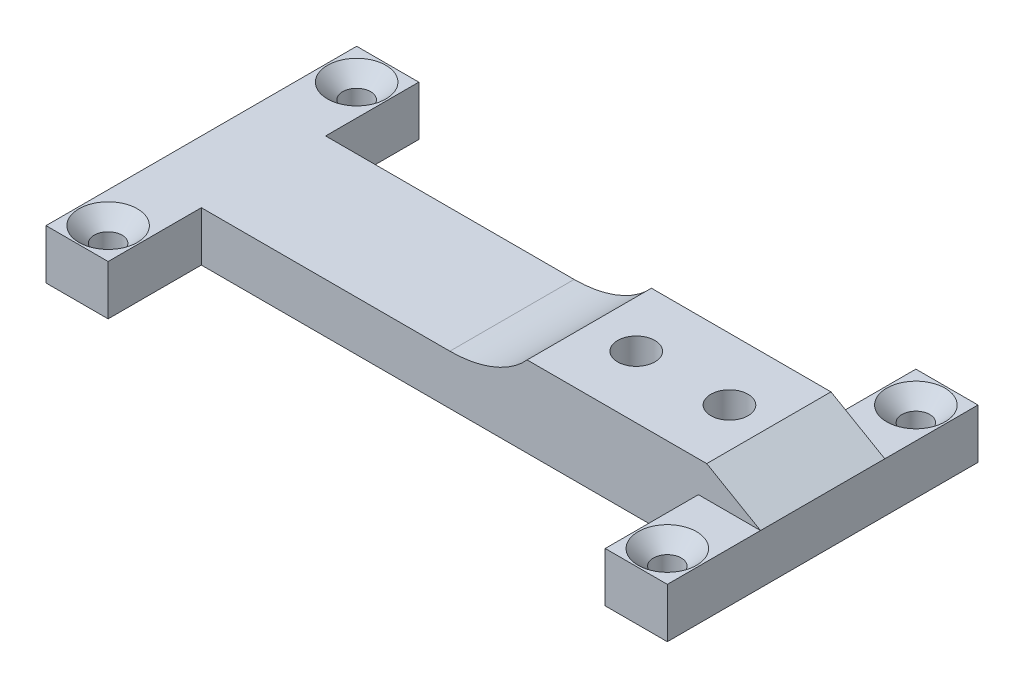
ISO-10303-21;
HEADER;
FILE_DESCRIPTION(('STEP AP214'),'2;1');
FILE_NAME('part.step','',(''),(''),'','','');
FILE_SCHEMA(('AUTOMOTIVE_DESIGN { 1 0 10303 214 1 1 1 1 }'));
ENDSEC;
DATA;
#1=APPLICATION_CONTEXT('core data for automotive mechanical design processes');
#2=APPLICATION_PROTOCOL_DEFINITION('international standard','automotive_design',2000,#1);
#3=PRODUCT_CONTEXT('',#1,'mechanical');
#4=PRODUCT('Part','Part','',(#3));
#5=PRODUCT_RELATED_PRODUCT_CATEGORY('part','',(#4));
#6=PRODUCT_DEFINITION_FORMATION('','',#4);
#7=PRODUCT_DEFINITION_CONTEXT('part definition',#1,'design');
#8=PRODUCT_DEFINITION('design','',#6,#7);
#9=PRODUCT_DEFINITION_SHAPE('','',#8);
#10=(LENGTH_UNIT() NAMED_UNIT(*) SI_UNIT(.MILLI.,.METRE.));
#11=(NAMED_UNIT(*) PLANE_ANGLE_UNIT() SI_UNIT($,.RADIAN.));
#12=(NAMED_UNIT(*) SI_UNIT($,.STERADIAN.) SOLID_ANGLE_UNIT());
#13=UNCERTAINTY_MEASURE_WITH_UNIT(LENGTH_MEASURE(1.E-05),#10,'distance_accuracy_value','');
#14=(GEOMETRIC_REPRESENTATION_CONTEXT(3) GLOBAL_UNCERTAINTY_ASSIGNED_CONTEXT((#13)) GLOBAL_UNIT_ASSIGNED_CONTEXT((#10,
#11,#12)) REPRESENTATION_CONTEXT('',''));
#15=CARTESIAN_POINT('',(0.,0.,0.));
#16=DIRECTION('',(0.,0.,1.));
#17=DIRECTION('',(1.,0.,0.));
#18=AXIS2_PLACEMENT_3D('',#15,#16,#17);
#19=CARTESIAN_POINT('',(0.,0.,0.));
#20=DIRECTION('',(0.,0.,1.));
#21=DIRECTION('',(1.,0.,0.));
#22=AXIS2_PLACEMENT_3D('',#19,#20,#21);
#23=PLANE('',#22);
#24=DIRECTION('',(-1.,0.,0.));
#25=VECTOR('',#24,1.);
#26=CARTESIAN_POINT('',(50.,-11.35,0.));
#27=LINE('',#26,#25);
#28=CARTESIAN_POINT('',(50.,-11.35,0.));
#29=VERTEX_POINT('',#28);
#30=CARTESIAN_POINT('',(40.,-11.35,0.));
#31=VERTEX_POINT('',#30);
#32=EDGE_CURVE('E64',#29,#31,#27,.T.);
#33=ORIENTED_EDGE('',*,*,#32,.T.);
#34=DIRECTION('',(0.,-1.,0.));
#35=VECTOR('',#34,1.);
#36=CARTESIAN_POINT('',(40.,-11.35,0.));
#37=LINE('',#36,#35);
#38=CARTESIAN_POINT('',(40.,-19.35,0.));
#39=VERTEX_POINT('',#38);
#40=EDGE_CURVE('E68',#31,#39,#37,.T.);
#41=ORIENTED_EDGE('',*,*,#40,.T.);
#42=DIRECTION('',(-1.,0.,0.));
#43=VECTOR('',#42,1.);
#44=CARTESIAN_POINT('',(0.,-19.35,0.));
#45=LINE('',#44,#43);
#46=CARTESIAN_POINT('',(-40.,-19.35,0.));
#47=VERTEX_POINT('',#46);
#48=EDGE_CURVE('E365',#39,#47,#45,.T.);
#49=ORIENTED_EDGE('',*,*,#48,.T.);
#50=DIRECTION('',(0.,-1.,0.));
#51=VECTOR('',#50,1.);
#52=CARTESIAN_POINT('',(-40.,-11.35,0.));
#53=LINE('',#52,#51);
#54=CARTESIAN_POINT('',(-40.,-11.35,0.));
#55=VERTEX_POINT('',#54);
#56=EDGE_CURVE('E217',#55,#47,#53,.T.);
#57=ORIENTED_EDGE('',*,*,#56,.F.);
#58=DIRECTION('',(-1.,0.,0.));
#59=VECTOR('',#58,1.);
#60=CARTESIAN_POINT('',(0.,-11.35,0.));
#61=LINE('',#60,#59);
#62=CARTESIAN_POINT('',(0.,-11.35,0.));
#63=VERTEX_POINT('',#62);
#64=EDGE_CURVE('E373',#63,#55,#61,.T.);
#65=ORIENTED_EDGE('',*,*,#64,.F.);
#66=CARTESIAN_POINT('',(0.,0.,0.));
#67=DIRECTION('',(0.,0.,1.));
#68=DIRECTION('',(-1.,0.,0.));
#69=AXIS2_PLACEMENT_3D('',#66,#67,#68);
#70=ELLIPSE('',#69,15.,11.35);
#71=CARTESIAN_POINT('',(12.4327451908988,-6.35,0.));
#72=VERTEX_POINT('',#71);
#73=EDGE_CURVE('E615',#63,#72,#70,.T.);
#74=ORIENTED_EDGE('',*,*,#73,.T.);
#75=DIRECTION('',(1.,0.,0.));
#76=VECTOR('',#75,1.);
#77=CARTESIAN_POINT('',(0.,-6.35,0.));
#78=LINE('',#77,#76);
#79=CARTESIAN_POINT('',(41.3397459621555,-6.35,0.));
#80=VERTEX_POINT('',#79);
#81=EDGE_CURVE('E609',#72,#80,#78,.T.);
#82=ORIENTED_EDGE('',*,*,#81,.T.);
#83=DIRECTION('',(-0.866025403784442,0.499999999999995,0.));
#84=VECTOR('',#83,1.);
#85=CARTESIAN_POINT('',(7.58530583352309,13.1381350946108,0.));
#86=LINE('',#85,#84);
#87=EDGE_CURVE('E607',#29,#80,#86,.T.);
#88=ORIENTED_EDGE('',*,*,#87,.F.);
#89=EDGE_LOOP('',(#33,#41,#49,#57,#65,#74,#82,#88));
#90=FACE_BOUND('',#89,.T.);
#91=ADVANCED_FACE('F47',(#90),#23,.F.);
#92=CARTESIAN_POINT('',(0.,0.,20.));
#93=DIRECTION('',(0.,0.,1.));
#94=DIRECTION('',(1.,0.,0.));
#95=AXIS2_PLACEMENT_3D('',#92,#93,#94);
#96=PLANE('',#95);
#97=DIRECTION('',(0.,-1.,0.));
#98=VECTOR('',#97,1.);
#99=CARTESIAN_POINT('',(40.,-11.35,20.));
#100=LINE('',#99,#98);
#101=CARTESIAN_POINT('',(40.,-11.35,20.));
#102=VERTEX_POINT('',#101);
#103=CARTESIAN_POINT('',(40.,-19.35,20.));
#104=VERTEX_POINT('',#103);
#105=EDGE_CURVE('E250',#102,#104,#100,.T.);
#106=ORIENTED_EDGE('',*,*,#105,.F.);
#107=DIRECTION('',(1.,0.,0.));
#108=VECTOR('',#107,1.);
#109=CARTESIAN_POINT('',(50.,-11.35,20.));
#110=LINE('',#109,#108);
#111=CARTESIAN_POINT('',(50.,-11.35,20.));
#112=VERTEX_POINT('',#111);
#113=EDGE_CURVE('E259',#102,#112,#110,.T.);
#114=ORIENTED_EDGE('',*,*,#113,.T.);
#115=DIRECTION('',(-0.866025403784442,0.499999999999995,0.));
#116=VECTOR('',#115,1.);
#117=CARTESIAN_POINT('',(7.58530583352309,13.1381350946108,20.));
#118=LINE('',#117,#116);
#119=CARTESIAN_POINT('',(41.3397459621555,-6.35,20.));
#120=VERTEX_POINT('',#119);
#121=EDGE_CURVE('E372',#112,#120,#118,.T.);
#122=ORIENTED_EDGE('',*,*,#121,.T.);
#123=DIRECTION('',(1.,0.,0.));
#124=VECTOR('',#123,1.);
#125=CARTESIAN_POINT('',(0.,-6.35,20.));
#126=LINE('',#125,#124);
#127=CARTESIAN_POINT('',(12.4327451908988,-6.35,20.));
#128=VERTEX_POINT('',#127);
#129=EDGE_CURVE('E376',#128,#120,#126,.T.);
#130=ORIENTED_EDGE('',*,*,#129,.F.);
#131=CARTESIAN_POINT('',(0.,0.,20.));
#132=DIRECTION('',(0.,0.,1.));
#133=DIRECTION('',(-1.,0.,0.));
#134=AXIS2_PLACEMENT_3D('',#131,#132,#133);
#135=ELLIPSE('',#134,15.,11.35);
#136=CARTESIAN_POINT('',(0.,-11.35,20.));
#137=VERTEX_POINT('',#136);
#138=EDGE_CURVE('E380',#137,#128,#135,.T.);
#139=ORIENTED_EDGE('',*,*,#138,.F.);
#140=DIRECTION('',(-1.,0.,0.));
#141=VECTOR('',#140,1.);
#142=CARTESIAN_POINT('',(0.,-11.35,20.));
#143=LINE('',#142,#141);
#144=CARTESIAN_POINT('',(-40.,-11.35,20.));
#145=VERTEX_POINT('',#144);
#146=EDGE_CURVE('E385',#137,#145,#143,.T.);
#147=ORIENTED_EDGE('',*,*,#146,.T.);
#148=DIRECTION('',(0.,-1.,0.));
#149=VECTOR('',#148,1.);
#150=CARTESIAN_POINT('',(-40.,-11.35,20.));
#151=LINE('',#150,#149);
#152=CARTESIAN_POINT('',(-40.,-19.35,20.));
#153=VERTEX_POINT('',#152);
#154=EDGE_CURVE('E295',#145,#153,#151,.T.);
#155=ORIENTED_EDGE('',*,*,#154,.T.);
#156=DIRECTION('',(-1.,0.,0.));
#157=VECTOR('',#156,1.);
#158=CARTESIAN_POINT('',(0.,-19.35,20.));
#159=LINE('',#158,#157);
#160=EDGE_CURVE('E369',#104,#153,#159,.T.);
#161=ORIENTED_EDGE('',*,*,#160,.F.);
#162=EDGE_LOOP('',(#106,#114,#122,#130,#139,#147,#155,#161));
#163=FACE_BOUND('',#162,.T.);
#164=ADVANCED_FACE('F416',(#163),#96,.T.);
#165=CARTESIAN_POINT('',(35.,-23.35,10.));
#166=DIRECTION('',(0.,1.,0.));
#167=DIRECTION('',(0.,0.,1.));
#168=AXIS2_PLACEMENT_3D('',#165,#166,#167);
#169=CYLINDRICAL_SURFACE('',#168,3.);
#170=CARTESIAN_POINT('',(35.,-6.35,10.));
#171=DIRECTION('',(0.,1.,0.));
#172=DIRECTION('',(0.,0.,1.));
#173=AXIS2_PLACEMENT_3D('',#170,#171,#172);
#174=CIRCLE('',#173,3.);
#175=CARTESIAN_POINT('',(35.,-6.35,13.));
#176=VERTEX_POINT('',#175);
#177=EDGE_CURVE('E360',#176,#176,#174,.T.);
#178=ORIENTED_EDGE('',*,*,#177,.T.);
#179=EDGE_LOOP('',(#178));
#180=FACE_BOUND('',#179,.T.);
#181=CARTESIAN_POINT('',(35.,-15.35,10.));
#182=DIRECTION('',(0.,-1.,0.));
#183=DIRECTION('',(1.,0.,0.));
#184=AXIS2_PLACEMENT_3D('',#181,#182,#183);
#185=CIRCLE('',#184,3.);
#186=CARTESIAN_POINT('',(38.,-15.35,10.));
#187=VERTEX_POINT('',#186);
#188=EDGE_CURVE('E356',#187,#187,#185,.F.);
#189=ORIENTED_EDGE('',*,*,#188,.F.);
#190=EDGE_LOOP('',(#189));
#191=FACE_BOUND('',#190,.T.);
#192=ADVANCED_FACE('F421',(#180,#191),#169,.F.);
#193=CARTESIAN_POINT('',(20.,-23.35,10.));
#194=DIRECTION('',(0.,1.,0.));
#195=DIRECTION('',(0.,0.,1.));
#196=AXIS2_PLACEMENT_3D('',#193,#194,#195);
#197=CYLINDRICAL_SURFACE('',#196,3.);
#198=CARTESIAN_POINT('',(20.,-6.35,10.));
#199=DIRECTION('',(0.,1.,0.));
#200=DIRECTION('',(0.,0.,1.));
#201=AXIS2_PLACEMENT_3D('',#198,#199,#200);
#202=CIRCLE('',#201,3.);
#203=CARTESIAN_POINT('',(20.,-6.35,13.));
#204=VERTEX_POINT('',#203);
#205=EDGE_CURVE('E361',#204,#204,#202,.T.);
#206=ORIENTED_EDGE('',*,*,#205,.T.);
#207=EDGE_LOOP('',(#206));
#208=FACE_BOUND('',#207,.T.);
#209=CARTESIAN_POINT('',(20.,-15.35,10.));
#210=DIRECTION('',(0.,-1.,0.));
#211=DIRECTION('',(1.,0.,0.));
#212=AXIS2_PLACEMENT_3D('',#209,#210,#211);
#213=CIRCLE('',#212,3.);
#214=CARTESIAN_POINT('',(23.,-15.35,10.));
#215=VERTEX_POINT('',#214);
#216=EDGE_CURVE('E51',#215,#215,#213,.F.);
#217=ORIENTED_EDGE('',*,*,#216,.F.);
#218=EDGE_LOOP('',(#217));
#219=FACE_BOUND('',#218,.T.);
#220=ADVANCED_FACE('F411',(#208,#219),#197,.F.);
#221=CARTESIAN_POINT('',(-50.,0.,20.));
#222=DIRECTION('',(-1.,0.,0.));
#223=DIRECTION('',(0.,0.,1.));
#224=AXIS2_PLACEMENT_3D('',#221,#222,#223);
#225=PLANE('',#224);
#226=DIRECTION('',(0.,0.,-1.));
#227=VECTOR('',#226,1.);
#228=CARTESIAN_POINT('',(-50.,-11.35,20.));
#229=LINE('',#228,#227);
#230=CARTESIAN_POINT('',(-50.,-11.35,35.));
#231=VERTEX_POINT('',#230);
#232=CARTESIAN_POINT('',(-50.,-11.35,-15.));
#233=VERTEX_POINT('',#232);
#234=EDGE_CURVE('E599',#231,#233,#229,.T.);
#235=ORIENTED_EDGE('',*,*,#234,.T.);
#236=DIRECTION('',(0.,-1.,0.));
#237=VECTOR('',#236,1.);
#238=CARTESIAN_POINT('',(-50.,-11.35,-15.));
#239=LINE('',#238,#237);
#240=CARTESIAN_POINT('',(-50.,-19.35,-15.));
#241=VERTEX_POINT('',#240);
#242=EDGE_CURVE('E230',#233,#241,#239,.T.);
#243=ORIENTED_EDGE('',*,*,#242,.T.);
#244=DIRECTION('',(0.,0.,-1.));
#245=VECTOR('',#244,1.);
#246=CARTESIAN_POINT('',(-50.,-19.35,20.));
#247=LINE('',#246,#245);
#248=CARTESIAN_POINT('',(-50.,-19.35,35.));
#249=VERTEX_POINT('',#248);
#250=EDGE_CURVE('E11',#249,#241,#247,.T.);
#251=ORIENTED_EDGE('',*,*,#250,.F.);
#252=DIRECTION('',(0.,-1.,0.));
#253=VECTOR('',#252,1.);
#254=CARTESIAN_POINT('',(-50.,-11.35,35.));
#255=LINE('',#254,#253);
#256=EDGE_CURVE('E302',#231,#249,#255,.T.);
#257=ORIENTED_EDGE('',*,*,#256,.F.);
#258=EDGE_LOOP('',(#235,#243,#251,#257));
#259=FACE_BOUND('',#258,.T.);
#260=ADVANCED_FACE('F49',(#259),#225,.T.);
#261=CARTESIAN_POINT('',(0.,-19.35,20.));
#262=DIRECTION('',(0.,-1.,0.));
#263=DIRECTION('',(1.,0.,0.));
#264=AXIS2_PLACEMENT_3D('',#261,#262,#263);
#265=PLANE('',#264);
#266=CARTESIAN_POINT('',(-45.,-19.35,-10.0000000000001));
#267=DIRECTION('',(0.,1.,0.));
#268=DIRECTION('',(0.,0.,1.));
#269=AXIS2_PLACEMENT_3D('',#266,#267,#268);
#270=CIRCLE('',#269,2.25);
#271=CARTESIAN_POINT('',(-45.,-19.35,-7.75000000000013));
#272=VERTEX_POINT('',#271);
#273=EDGE_CURVE('E531',#272,#272,#270,.T.);
#274=ORIENTED_EDGE('',*,*,#273,.T.);
#275=EDGE_LOOP('',(#274));
#276=FACE_BOUND('',#275,.T.);
#277=CARTESIAN_POINT('',(-45.,-19.35,30.));
#278=DIRECTION('',(0.,1.,0.));
#279=DIRECTION('',(0.,0.,1.));
#280=AXIS2_PLACEMENT_3D('',#277,#278,#279);
#281=CIRCLE('',#280,2.25);
#282=CARTESIAN_POINT('',(-45.,-19.35,32.25));
#283=VERTEX_POINT('',#282);
#284=EDGE_CURVE('E544',#283,#283,#281,.T.);
#285=ORIENTED_EDGE('',*,*,#284,.T.);
#286=EDGE_LOOP('',(#285));
#287=FACE_BOUND('',#286,.T.);
#288=CARTESIAN_POINT('',(45.,-19.35,30.));
#289=DIRECTION('',(0.,1.,0.));
#290=DIRECTION('',(0.,0.,1.));
#291=AXIS2_PLACEMENT_3D('',#288,#289,#290);
#292=CIRCLE('',#291,2.25);
#293=CARTESIAN_POINT('',(45.,-19.35,32.25));
#294=VERTEX_POINT('',#293);
#295=EDGE_CURVE('E556',#294,#294,#292,.T.);
#296=ORIENTED_EDGE('',*,*,#295,.T.);
#297=EDGE_LOOP('',(#296));
#298=FACE_BOUND('',#297,.T.);
#299=CARTESIAN_POINT('',(45.,-19.35,-9.99999999999991));
#300=DIRECTION('',(0.,1.,0.));
#301=DIRECTION('',(0.,0.,1.));
#302=AXIS2_PLACEMENT_3D('',#299,#300,#301);
#303=CIRCLE('',#302,2.25);
#304=CARTESIAN_POINT('',(45.,-19.35,-7.74999999999991));
#305=VERTEX_POINT('',#304);
#306=EDGE_CURVE('E206',#305,#305,#303,.T.);
#307=ORIENTED_EDGE('',*,*,#306,.T.);
#308=EDGE_LOOP('',(#307));
#309=FACE_BOUND('',#308,.T.);
#310=CARTESIAN_POINT('',(20.,-19.35,10.));
#311=DIRECTION('',(0.,-1.,0.));
#312=DIRECTION('',(1.,0.,0.));
#313=AXIS2_PLACEMENT_3D('',#310,#311,#312);
#314=CIRCLE('',#313,5.5);
#315=CARTESIAN_POINT('',(20.,-19.35,15.5));
#316=VERTEX_POINT('',#315);
#317=CARTESIAN_POINT('',(20.,-19.35,4.5));
#318=VERTEX_POINT('',#317);
#319=EDGE_CURVE('E306',#316,#318,#314,.T.);
#320=ORIENTED_EDGE('',*,*,#319,.F.);
#321=DIRECTION('',(-1.,0.,0.));
#322=VECTOR('',#321,1.);
#323=CARTESIAN_POINT('',(20.,-19.35,15.5));
#324=LINE('',#323,#322);
#325=CARTESIAN_POINT('',(35.,-19.35,15.5));
#326=VERTEX_POINT('',#325);
#327=EDGE_CURVE('E318',#326,#316,#324,.T.);
#328=ORIENTED_EDGE('',*,*,#327,.F.);
#329=CARTESIAN_POINT('',(35.,-19.35,10.));
#330=DIRECTION('',(0.,-1.,0.));
#331=DIRECTION('',(1.,0.,0.));
#332=AXIS2_PLACEMENT_3D('',#329,#330,#331);
#333=CIRCLE('',#332,5.5);
#334=CARTESIAN_POINT('',(35.,-19.35,4.5));
#335=VERTEX_POINT('',#334);
#336=EDGE_CURVE('E337',#335,#326,#333,.T.);
#337=ORIENTED_EDGE('',*,*,#336,.F.);
#338=DIRECTION('',(1.,0.,0.));
#339=VECTOR('',#338,1.);
#340=CARTESIAN_POINT('',(20.,-19.35,4.5));
#341=LINE('',#340,#339);
#342=EDGE_CURVE('E333',#318,#335,#341,.T.);
#343=ORIENTED_EDGE('',*,*,#342,.F.);
#344=EDGE_LOOP('',(#320,#328,#337,#343));
#345=FACE_BOUND('',#344,.T.);
#346=ORIENTED_EDGE('',*,*,#48,.F.);
#347=DIRECTION('',(0.,0.,-1.));
#348=VECTOR('',#347,1.);
#349=CARTESIAN_POINT('',(40.,-19.35,0.));
#350=LINE('',#349,#348);
#351=CARTESIAN_POINT('',(40.,-19.35,-15.));
#352=VERTEX_POINT('',#351);
#353=EDGE_CURVE('E211',#39,#352,#350,.T.);
#354=ORIENTED_EDGE('',*,*,#353,.T.);
#355=DIRECTION('',(1.,0.,0.));
#356=VECTOR('',#355,1.);
#357=CARTESIAN_POINT('',(50.,-19.35,-15.));
#358=LINE('',#357,#356);
#359=CARTESIAN_POINT('',(50.,-19.35,-15.));
#360=VERTEX_POINT('',#359);
#361=EDGE_CURVE('E201',#352,#360,#358,.T.);
#362=ORIENTED_EDGE('',*,*,#361,.T.);
#363=DIRECTION('',(0.,0.,-1.));
#364=VECTOR('',#363,1.);
#365=CARTESIAN_POINT('',(50.,-19.35,20.));
#366=LINE('',#365,#364);
#367=CARTESIAN_POINT('',(50.,-19.35,35.));
#368=VERTEX_POINT('',#367);
#369=EDGE_CURVE('E57',#368,#360,#366,.T.);
#370=ORIENTED_EDGE('',*,*,#369,.F.);
#371=DIRECTION('',(-1.,0.,0.));
#372=VECTOR('',#371,1.);
#373=CARTESIAN_POINT('',(50.,-19.35,35.));
#374=LINE('',#373,#372);
#375=CARTESIAN_POINT('',(40.,-19.35,35.));
#376=VERTEX_POINT('',#375);
#377=EDGE_CURVE('E269',#368,#376,#374,.T.);
#378=ORIENTED_EDGE('',*,*,#377,.T.);
#379=DIRECTION('',(0.,0.,-1.));
#380=VECTOR('',#379,1.);
#381=CARTESIAN_POINT('',(40.,-19.35,20.));
#382=LINE('',#381,#380);
#383=EDGE_CURVE('E265',#376,#104,#382,.T.);
#384=ORIENTED_EDGE('',*,*,#383,.T.);
#385=ORIENTED_EDGE('',*,*,#160,.T.);
#386=DIRECTION('',(0.,0.,1.));
#387=VECTOR('',#386,1.);
#388=CARTESIAN_POINT('',(-40.,-19.35,20.));
#389=LINE('',#388,#387);
#390=CARTESIAN_POINT('',(-40.,-19.35,35.));
#391=VERTEX_POINT('',#390);
#392=EDGE_CURVE('E273',#153,#391,#389,.T.);
#393=ORIENTED_EDGE('',*,*,#392,.T.);
#394=DIRECTION('',(-1.,0.,0.));
#395=VECTOR('',#394,1.);
#396=CARTESIAN_POINT('',(-50.,-19.35,35.));
#397=LINE('',#396,#395);
#398=EDGE_CURVE('E291',#391,#249,#397,.T.);
#399=ORIENTED_EDGE('',*,*,#398,.T.);
#400=ORIENTED_EDGE('',*,*,#250,.T.);
#401=DIRECTION('',(1.,0.,0.));
#402=VECTOR('',#401,1.);
#403=CARTESIAN_POINT('',(-50.,-19.35,-15.));
#404=LINE('',#403,#402);
#405=CARTESIAN_POINT('',(-40.,-19.35,-15.));
#406=VERTEX_POINT('',#405);
#407=EDGE_CURVE('E245',#241,#406,#404,.T.);
#408=ORIENTED_EDGE('',*,*,#407,.T.);
#409=DIRECTION('',(0.,0.,1.));
#410=VECTOR('',#409,1.);
#411=CARTESIAN_POINT('',(-40.,-19.35,0.));
#412=LINE('',#411,#410);
#413=EDGE_CURVE('E241',#406,#47,#412,.T.);
#414=ORIENTED_EDGE('',*,*,#413,.T.);
#415=EDGE_LOOP('',(#346,#354,#362,#370,#378,#384,#385,#393,#399,#400,#408,#414));
#416=FACE_BOUND('',#415,.T.);
#417=ADVANCED_FACE('F209',(#276,#287,#298,#309,#345,#416),#265,.T.);
#418=CARTESIAN_POINT('',(50.,0.,20.));
#419=DIRECTION('',(1.,0.,0.));
#420=DIRECTION('',(0.,0.,-1.));
#421=AXIS2_PLACEMENT_3D('',#418,#419,#420);
#422=PLANE('',#421);
#423=ORIENTED_EDGE('',*,*,#369,.T.);
#424=DIRECTION('',(0.,-1.,0.));
#425=VECTOR('',#424,1.);
#426=CARTESIAN_POINT('',(50.,-11.35,-15.));
#427=LINE('',#426,#425);
#428=CARTESIAN_POINT('',(50.,-11.35,-15.));
#429=VERTEX_POINT('',#428);
#430=EDGE_CURVE('E186',#429,#360,#427,.T.);
#431=ORIENTED_EDGE('',*,*,#430,.F.);
#432=DIRECTION('',(0.,0.,1.));
#433=VECTOR('',#432,1.);
#434=CARTESIAN_POINT('',(50.,-11.35,0.));
#435=LINE('',#434,#433);
#436=EDGE_CURVE('E213',#429,#29,#435,.T.);
#437=ORIENTED_EDGE('',*,*,#436,.T.);
#438=DIRECTION('',(0.,0.,-1.));
#439=VECTOR('',#438,1.);
#440=CARTESIAN_POINT('',(50.,-11.35,20.));
#441=LINE('',#440,#439);
#442=EDGE_CURVE('E195',#112,#29,#441,.T.);
#443=ORIENTED_EDGE('',*,*,#442,.F.);
#444=DIRECTION('',(0.,0.,1.));
#445=VECTOR('',#444,1.);
#446=CARTESIAN_POINT('',(50.,-11.35,20.));
#447=LINE('',#446,#445);
#448=CARTESIAN_POINT('',(50.,-11.35,35.));
#449=VERTEX_POINT('',#448);
#450=EDGE_CURVE('E270',#112,#449,#447,.T.);
#451=ORIENTED_EDGE('',*,*,#450,.T.);
#452=DIRECTION('',(0.,-1.,0.));
#453=VECTOR('',#452,1.);
#454=CARTESIAN_POINT('',(50.,-11.35,35.));
#455=LINE('',#454,#453);
#456=EDGE_CURVE('E189',#449,#368,#455,.T.);
#457=ORIENTED_EDGE('',*,*,#456,.T.);
#458=EDGE_LOOP('',(#423,#431,#437,#443,#451,#457));
#459=FACE_BOUND('',#458,.T.);
#460=ADVANCED_FACE('F184',(#459),#422,.T.);
#461=CARTESIAN_POINT('',(7.58530583352309,13.1381350946108,20.));
#462=DIRECTION('',(-0.499999999999995,-0.866025403784442,0.));
#463=DIRECTION('',(0.866025403784442,-0.499999999999995,0.));
#464=AXIS2_PLACEMENT_3D('',#461,#462,#463);
#465=PLANE('',#464);
#466=ORIENTED_EDGE('',*,*,#87,.T.);
#467=DIRECTION('',(0.,0.,-1.));
#468=VECTOR('',#467,1.);
#469=CARTESIAN_POINT('',(41.3397459621555,-6.35,20.));
#470=LINE('',#469,#468);
#471=EDGE_CURVE('E579',#120,#80,#470,.T.);
#472=ORIENTED_EDGE('',*,*,#471,.F.);
#473=ORIENTED_EDGE('',*,*,#121,.F.);
#474=ORIENTED_EDGE('',*,*,#442,.T.);
#475=EDGE_LOOP('',(#466,#472,#473,#474));
#476=FACE_BOUND('',#475,.T.);
#477=ADVANCED_FACE('F398',(#476),#465,.F.);
#478=CARTESIAN_POINT('',(0.,-6.35,20.));
#479=DIRECTION('',(0.,1.,0.));
#480=DIRECTION('',(0.,0.,1.));
#481=AXIS2_PLACEMENT_3D('',#478,#479,#480);
#482=PLANE('',#481);
#483=ORIENTED_EDGE('',*,*,#205,.F.);
#484=EDGE_LOOP('',(#483));
#485=FACE_BOUND('',#484,.T.);
#486=ORIENTED_EDGE('',*,*,#177,.F.);
#487=EDGE_LOOP('',(#486));
#488=FACE_BOUND('',#487,.T.);
#489=ORIENTED_EDGE('',*,*,#81,.F.);
#490=DIRECTION('',(0.,0.,-1.));
#491=VECTOR('',#490,1.);
#492=CARTESIAN_POINT('',(12.4327451908988,-6.35,20.));
#493=LINE('',#492,#491);
#494=EDGE_CURVE('E626',#128,#72,#493,.T.);
#495=ORIENTED_EDGE('',*,*,#494,.F.);
#496=ORIENTED_EDGE('',*,*,#129,.T.);
#497=ORIENTED_EDGE('',*,*,#471,.T.);
#498=EDGE_LOOP('',(#489,#495,#496,#497));
#499=FACE_BOUND('',#498,.T.);
#500=ADVANCED_FACE('F393',(#485,#488,#499),#482,.T.);
#501=DIRECTION('',(0.,0.,-1.));
#502=VECTOR('',#501,1.);
#503=SURFACE_OF_LINEAR_EXTRUSION('',#135,#502);
#504=ORIENTED_EDGE('',*,*,#73,.F.);
#505=DIRECTION('',(0.,0.,-1.));
#506=VECTOR('',#505,1.);
#507=CARTESIAN_POINT('',(0.,-11.35,20.));
#508=LINE('',#507,#506);
#509=EDGE_CURVE('E623',#137,#63,#508,.T.);
#510=ORIENTED_EDGE('',*,*,#509,.F.);
#511=ORIENTED_EDGE('',*,*,#138,.T.);
#512=ORIENTED_EDGE('',*,*,#494,.T.);
#513=EDGE_LOOP('',(#504,#510,#511,#512));
#514=FACE_BOUND('',#513,.T.);
#515=ADVANCED_FACE('F388',(#514),#503,.T.);
#516=CARTESIAN_POINT('',(0.,-11.35,20.));
#517=DIRECTION('',(0.,-1.,0.));
#518=DIRECTION('',(1.,0.,0.));
#519=AXIS2_PLACEMENT_3D('',#516,#517,#518);
#520=PLANE('',#519);
#521=CARTESIAN_POINT('',(-45.,-11.35,-10.0000000000001));
#522=DIRECTION('',(0.,1.,0.));
#523=DIRECTION('',(0.,0.,1.));
#524=AXIS2_PLACEMENT_3D('',#521,#522,#523);
#525=CIRCLE('',#524,4.7);
#526=CARTESIAN_POINT('',(-45.,-11.35,-5.30000000000012));
#527=VERTEX_POINT('',#526);
#528=EDGE_CURVE('E526',#527,#527,#525,.T.);
#529=ORIENTED_EDGE('',*,*,#528,.F.);
#530=EDGE_LOOP('',(#529));
#531=FACE_BOUND('',#530,.T.);
#532=CARTESIAN_POINT('',(-45.,-11.35,30.));
#533=DIRECTION('',(0.,1.,0.));
#534=DIRECTION('',(0.,0.,1.));
#535=AXIS2_PLACEMENT_3D('',#532,#533,#534);
#536=CIRCLE('',#535,4.7);
#537=CARTESIAN_POINT('',(-45.,-11.35,34.7));
#538=VERTEX_POINT('',#537);
#539=EDGE_CURVE('E536',#538,#538,#536,.T.);
#540=ORIENTED_EDGE('',*,*,#539,.F.);
#541=EDGE_LOOP('',(#540));
#542=FACE_BOUND('',#541,.T.);
#543=ORIENTED_EDGE('',*,*,#64,.T.);
#544=DIRECTION('',(0.,0.,1.));
#545=VECTOR('',#544,1.);
#546=CARTESIAN_POINT('',(-40.,-11.35,0.));
#547=LINE('',#546,#545);
#548=CARTESIAN_POINT('',(-40.,-11.35,-15.));
#549=VERTEX_POINT('',#548);
#550=EDGE_CURVE('E234',#549,#55,#547,.T.);
#551=ORIENTED_EDGE('',*,*,#550,.F.);
#552=DIRECTION('',(1.,0.,0.));
#553=VECTOR('',#552,1.);
#554=CARTESIAN_POINT('',(-50.,-11.35,-15.));
#555=LINE('',#554,#553);
#556=EDGE_CURVE('E246',#233,#549,#555,.T.);
#557=ORIENTED_EDGE('',*,*,#556,.F.);
#558=ORIENTED_EDGE('',*,*,#234,.F.);
#559=DIRECTION('',(-1.,0.,0.));
#560=VECTOR('',#559,1.);
#561=CARTESIAN_POINT('',(-50.,-11.35,35.));
#562=LINE('',#561,#560);
#563=CARTESIAN_POINT('',(-40.,-11.35,35.));
#564=VERTEX_POINT('',#563);
#565=EDGE_CURVE('E290',#564,#231,#562,.T.);
#566=ORIENTED_EDGE('',*,*,#565,.F.);
#567=DIRECTION('',(0.,0.,1.));
#568=VECTOR('',#567,1.);
#569=CARTESIAN_POINT('',(-40.,-11.35,20.));
#570=LINE('',#569,#568);
#571=EDGE_CURVE('E286',#145,#564,#570,.T.);
#572=ORIENTED_EDGE('',*,*,#571,.F.);
#573=ORIENTED_EDGE('',*,*,#146,.F.);
#574=ORIENTED_EDGE('',*,*,#509,.T.);
#575=EDGE_LOOP('',(#543,#551,#557,#558,#566,#572,#573,#574));
#576=FACE_BOUND('',#575,.T.);
#577=ADVANCED_FACE('F392',(#531,#542,#576),#520,.F.);
#578=CARTESIAN_POINT('',(20.,-15.35,10.));
#579=DIRECTION('',(0.,-1.,0.));
#580=DIRECTION('',(1.,0.,0.));
#581=AXIS2_PLACEMENT_3D('',#578,#579,#580);
#582=PLANE('',#581);
#583=CARTESIAN_POINT('',(20.,-15.35,10.));
#584=DIRECTION('',(0.,-1.,0.));
#585=DIRECTION('',(1.,0.,0.));
#586=AXIS2_PLACEMENT_3D('',#583,#584,#585);
#587=CIRCLE('',#586,5.5);
#588=CARTESIAN_POINT('',(20.,-15.35,15.5));
#589=VERTEX_POINT('',#588);
#590=CARTESIAN_POINT('',(20.,-15.35,4.5));
#591=VERTEX_POINT('',#590);
#592=EDGE_CURVE('E313',#589,#591,#587,.T.);
#593=ORIENTED_EDGE('',*,*,#592,.T.);
#594=DIRECTION('',(1.,0.,0.));
#595=VECTOR('',#594,1.);
#596=CARTESIAN_POINT('',(20.,-15.35,4.5));
#597=LINE('',#596,#595);
#598=CARTESIAN_POINT('',(35.,-15.35,4.5));
#599=VERTEX_POINT('',#598);
#600=EDGE_CURVE('E317',#591,#599,#597,.T.);
#601=ORIENTED_EDGE('',*,*,#600,.T.);
#602=CARTESIAN_POINT('',(35.,-15.35,10.));
#603=DIRECTION('',(0.,-1.,0.));
#604=DIRECTION('',(1.,0.,0.));
#605=AXIS2_PLACEMENT_3D('',#602,#603,#604);
#606=CIRCLE('',#605,5.5);
#607=CARTESIAN_POINT('',(35.,-15.35,15.5));
#608=VERTEX_POINT('',#607);
#609=EDGE_CURVE('E322',#599,#608,#606,.T.);
#610=ORIENTED_EDGE('',*,*,#609,.T.);
#611=DIRECTION('',(-1.,0.,0.));
#612=VECTOR('',#611,1.);
#613=CARTESIAN_POINT('',(20.,-15.35,15.5));
#614=LINE('',#613,#612);
#615=EDGE_CURVE('E326',#608,#589,#614,.T.);
#616=ORIENTED_EDGE('',*,*,#615,.T.);
#617=EDGE_LOOP('',(#593,#601,#610,#616));
#618=FACE_BOUND('',#617,.T.);
#619=ORIENTED_EDGE('',*,*,#216,.T.);
#620=EDGE_LOOP('',(#619));
#621=FACE_BOUND('',#620,.T.);
#622=ORIENTED_EDGE('',*,*,#188,.T.);
#623=EDGE_LOOP('',(#622));
#624=FACE_BOUND('',#623,.T.);
#625=ADVANCED_FACE('F435',(#618,#621,#624),#582,.T.);
#626=CARTESIAN_POINT('',(20.,-15.35,10.));
#627=DIRECTION('',(0.,-1.,0.));
#628=DIRECTION('',(1.,0.,0.));
#629=AXIS2_PLACEMENT_3D('',#626,#627,#628);
#630=CYLINDRICAL_SURFACE('',#629,5.5);
#631=ORIENTED_EDGE('',*,*,#319,.T.);
#632=DIRECTION('',(0.,-1.,0.));
#633=VECTOR('',#632,1.);
#634=CARTESIAN_POINT('',(20.,-15.35,4.5));
#635=LINE('',#634,#633);
#636=EDGE_CURVE('E330',#591,#318,#635,.T.);
#637=ORIENTED_EDGE('',*,*,#636,.F.);
#638=ORIENTED_EDGE('',*,*,#592,.F.);
#639=DIRECTION('',(0.,-1.,0.));
#640=VECTOR('',#639,1.);
#641=CARTESIAN_POINT('',(20.,-15.35,15.5));
#642=LINE('',#641,#640);
#643=EDGE_CURVE('E344',#589,#316,#642,.T.);
#644=ORIENTED_EDGE('',*,*,#643,.T.);
#645=EDGE_LOOP('',(#631,#637,#638,#644));
#646=FACE_BOUND('',#645,.T.);
#647=ADVANCED_FACE('F431',(#646),#630,.F.);
#648=CARTESIAN_POINT('',(20.,-15.35,15.5));
#649=DIRECTION('',(0.,0.,1.));
#650=DIRECTION('',(1.,0.,0.));
#651=AXIS2_PLACEMENT_3D('',#648,#649,#650);
#652=PLANE('',#651);
#653=ORIENTED_EDGE('',*,*,#327,.T.);
#654=ORIENTED_EDGE('',*,*,#643,.F.);
#655=ORIENTED_EDGE('',*,*,#615,.F.);
#656=DIRECTION('',(0.,-1.,0.));
#657=VECTOR('',#656,1.);
#658=CARTESIAN_POINT('',(35.,-15.35,15.5));
#659=LINE('',#658,#657);
#660=EDGE_CURVE('E347',#608,#326,#659,.T.);
#661=ORIENTED_EDGE('',*,*,#660,.T.);
#662=EDGE_LOOP('',(#653,#654,#655,#661));
#663=FACE_BOUND('',#662,.T.);
#664=ADVANCED_FACE('F434',(#663),#652,.F.);
#665=CARTESIAN_POINT('',(35.,-15.35,10.));
#666=DIRECTION('',(0.,-1.,0.));
#667=DIRECTION('',(1.,0.,0.));
#668=AXIS2_PLACEMENT_3D('',#665,#666,#667);
#669=CYLINDRICAL_SURFACE('',#668,5.5);
#670=ORIENTED_EDGE('',*,*,#336,.T.);
#671=ORIENTED_EDGE('',*,*,#660,.F.);
#672=ORIENTED_EDGE('',*,*,#609,.F.);
#673=DIRECTION('',(0.,-1.,0.));
#674=VECTOR('',#673,1.);
#675=CARTESIAN_POINT('',(35.,-15.35,4.5));
#676=LINE('',#675,#674);
#677=EDGE_CURVE('E350',#599,#335,#676,.T.);
#678=ORIENTED_EDGE('',*,*,#677,.T.);
#679=EDGE_LOOP('',(#670,#671,#672,#678));
#680=FACE_BOUND('',#679,.T.);
#681=ADVANCED_FACE('F440',(#680),#669,.F.);
#682=CARTESIAN_POINT('',(20.,-15.35,4.5));
#683=DIRECTION('',(0.,0.,-1.));
#684=DIRECTION('',(-1.,0.,0.));
#685=AXIS2_PLACEMENT_3D('',#682,#683,#684);
#686=PLANE('',#685);
#687=ORIENTED_EDGE('',*,*,#342,.T.);
#688=ORIENTED_EDGE('',*,*,#677,.F.);
#689=ORIENTED_EDGE('',*,*,#600,.F.);
#690=ORIENTED_EDGE('',*,*,#636,.T.);
#691=EDGE_LOOP('',(#687,#688,#689,#690));
#692=FACE_BOUND('',#691,.T.);
#693=ADVANCED_FACE('F437',(#692),#686,.F.);
#694=CARTESIAN_POINT('',(-50.,-11.35,35.));
#695=DIRECTION('',(0.,0.,1.));
#696=DIRECTION('',(1.,0.,0.));
#697=AXIS2_PLACEMENT_3D('',#694,#695,#696);
#698=PLANE('',#697);
#699=ORIENTED_EDGE('',*,*,#398,.F.);
#700=DIRECTION('',(0.,-1.,0.));
#701=VECTOR('',#700,1.);
#702=CARTESIAN_POINT('',(-40.,-11.35,35.));
#703=LINE('',#702,#701);
#704=EDGE_CURVE('E307',#564,#391,#703,.T.);
#705=ORIENTED_EDGE('',*,*,#704,.F.);
#706=ORIENTED_EDGE('',*,*,#565,.T.);
#707=ORIENTED_EDGE('',*,*,#256,.T.);
#708=EDGE_LOOP('',(#699,#705,#706,#707));
#709=FACE_BOUND('',#708,.T.);
#710=ADVANCED_FACE('F439',(#709),#698,.T.);
#711=CARTESIAN_POINT('',(-40.,-11.35,20.));
#712=DIRECTION('',(1.,0.,0.));
#713=DIRECTION('',(0.,1.,0.));
#714=AXIS2_PLACEMENT_3D('',#711,#712,#713);
#715=PLANE('',#714);
#716=ORIENTED_EDGE('',*,*,#392,.F.);
#717=ORIENTED_EDGE('',*,*,#154,.F.);
#718=ORIENTED_EDGE('',*,*,#571,.T.);
#719=ORIENTED_EDGE('',*,*,#704,.T.);
#720=EDGE_LOOP('',(#716,#717,#718,#719));
#721=FACE_BOUND('',#720,.T.);
#722=ADVANCED_FACE('F451',(#721),#715,.T.);
#723=CARTESIAN_POINT('',(40.,-11.35,20.));
#724=DIRECTION('',(-1.,0.,0.));
#725=DIRECTION('',(0.,-1.,0.));
#726=AXIS2_PLACEMENT_3D('',#723,#724,#725);
#727=PLANE('',#726);
#728=ORIENTED_EDGE('',*,*,#383,.F.);
#729=DIRECTION('',(0.,-1.,0.));
#730=VECTOR('',#729,1.);
#731=CARTESIAN_POINT('',(40.,-11.35,35.));
#732=LINE('',#731,#730);
#733=CARTESIAN_POINT('',(40.,-11.35,35.));
#734=VERTEX_POINT('',#733);
#735=EDGE_CURVE('E260',#734,#376,#732,.T.);
#736=ORIENTED_EDGE('',*,*,#735,.F.);
#737=DIRECTION('',(0.,0.,-1.));
#738=VECTOR('',#737,1.);
#739=CARTESIAN_POINT('',(40.,-11.35,20.));
#740=LINE('',#739,#738);
#741=EDGE_CURVE('E277',#734,#102,#740,.T.);
#742=ORIENTED_EDGE('',*,*,#741,.T.);
#743=ORIENTED_EDGE('',*,*,#105,.T.);
#744=EDGE_LOOP('',(#728,#736,#742,#743));
#745=FACE_BOUND('',#744,.T.);
#746=ADVANCED_FACE('F454',(#745),#727,.T.);
#747=CARTESIAN_POINT('',(50.,-11.35,35.));
#748=DIRECTION('',(0.,0.,1.));
#749=DIRECTION('',(1.,0.,0.));
#750=AXIS2_PLACEMENT_3D('',#747,#748,#749);
#751=PLANE('',#750);
#752=ORIENTED_EDGE('',*,*,#377,.F.);
#753=ORIENTED_EDGE('',*,*,#456,.F.);
#754=DIRECTION('',(-1.,0.,0.));
#755=VECTOR('',#754,1.);
#756=CARTESIAN_POINT('',(50.,-11.35,35.));
#757=LINE('',#756,#755);
#758=EDGE_CURVE('E280',#449,#734,#757,.T.);
#759=ORIENTED_EDGE('',*,*,#758,.T.);
#760=ORIENTED_EDGE('',*,*,#735,.T.);
#761=EDGE_LOOP('',(#752,#753,#759,#760));
#762=FACE_BOUND('',#761,.T.);
#763=ADVANCED_FACE('F463',(#762),#751,.T.);
#764=CARTESIAN_POINT('',(0.,-11.35,0.));
#765=DIRECTION('',(0.,-1.,0.));
#766=DIRECTION('',(0.,0.,-1.));
#767=AXIS2_PLACEMENT_3D('',#764,#765,#766);
#768=PLANE('',#767);
#769=CARTESIAN_POINT('',(45.,-11.35,30.));
#770=DIRECTION('',(0.,1.,0.));
#771=DIRECTION('',(0.,0.,1.));
#772=AXIS2_PLACEMENT_3D('',#769,#770,#771);
#773=CIRCLE('',#772,4.7);
#774=CARTESIAN_POINT('',(45.,-11.35,34.7));
#775=VERTEX_POINT('',#774);
#776=EDGE_CURVE('E548',#775,#775,#773,.T.);
#777=ORIENTED_EDGE('',*,*,#776,.F.);
#778=EDGE_LOOP('',(#777));
#779=FACE_BOUND('',#778,.T.);
#780=ORIENTED_EDGE('',*,*,#450,.F.);
#781=ORIENTED_EDGE('',*,*,#113,.F.);
#782=ORIENTED_EDGE('',*,*,#741,.F.);
#783=ORIENTED_EDGE('',*,*,#758,.F.);
#784=EDGE_LOOP('',(#780,#781,#782,#783));
#785=FACE_BOUND('',#784,.T.);
#786=ADVANCED_FACE('F459',(#779,#785),#768,.F.);
#787=CARTESIAN_POINT('',(-40.,-11.35,0.));
#788=DIRECTION('',(1.,0.,0.));
#789=DIRECTION('',(0.,1.,0.));
#790=AXIS2_PLACEMENT_3D('',#787,#788,#789);
#791=PLANE('',#790);
#792=ORIENTED_EDGE('',*,*,#413,.F.);
#793=DIRECTION('',(0.,-1.,0.));
#794=VECTOR('',#793,1.);
#795=CARTESIAN_POINT('',(-40.,-11.35,-15.));
#796=LINE('',#795,#794);
#797=EDGE_CURVE('E235',#549,#406,#796,.T.);
#798=ORIENTED_EDGE('',*,*,#797,.F.);
#799=ORIENTED_EDGE('',*,*,#550,.T.);
#800=ORIENTED_EDGE('',*,*,#56,.T.);
#801=EDGE_LOOP('',(#792,#798,#799,#800));
#802=FACE_BOUND('',#801,.T.);
#803=ADVANCED_FACE('F462',(#802),#791,.T.);
#804=CARTESIAN_POINT('',(-50.,-11.35,-15.));
#805=DIRECTION('',(0.,0.,-1.));
#806=DIRECTION('',(-1.,0.,0.));
#807=AXIS2_PLACEMENT_3D('',#804,#805,#806);
#808=PLANE('',#807);
#809=ORIENTED_EDGE('',*,*,#407,.F.);
#810=ORIENTED_EDGE('',*,*,#242,.F.);
#811=ORIENTED_EDGE('',*,*,#556,.T.);
#812=ORIENTED_EDGE('',*,*,#797,.T.);
#813=EDGE_LOOP('',(#809,#810,#811,#812));
#814=FACE_BOUND('',#813,.T.);
#815=ADVANCED_FACE('F473',(#814),#808,.T.);
#816=CARTESIAN_POINT('',(50.,-11.35,-15.));
#817=DIRECTION('',(0.,0.,-1.));
#818=DIRECTION('',(-1.,0.,0.));
#819=AXIS2_PLACEMENT_3D('',#816,#817,#818);
#820=PLANE('',#819);
#821=ORIENTED_EDGE('',*,*,#361,.F.);
#822=DIRECTION('',(0.,-1.,0.));
#823=VECTOR('',#822,1.);
#824=CARTESIAN_POINT('',(40.,-11.35,-15.));
#825=LINE('',#824,#823);
#826=CARTESIAN_POINT('',(40.,-11.35,-15.));
#827=VERTEX_POINT('',#826);
#828=EDGE_CURVE('E205',#827,#352,#825,.T.);
#829=ORIENTED_EDGE('',*,*,#828,.F.);
#830=DIRECTION('',(1.,0.,0.));
#831=VECTOR('',#830,1.);
#832=CARTESIAN_POINT('',(50.,-11.35,-15.));
#833=LINE('',#832,#831);
#834=EDGE_CURVE('E203',#827,#429,#833,.T.);
#835=ORIENTED_EDGE('',*,*,#834,.T.);
#836=ORIENTED_EDGE('',*,*,#430,.T.);
#837=EDGE_LOOP('',(#821,#829,#835,#836));
#838=FACE_BOUND('',#837,.T.);
#839=ADVANCED_FACE('F200',(#838),#820,.T.);
#840=CARTESIAN_POINT('',(40.,-11.35,0.));
#841=DIRECTION('',(-1.,0.,0.));
#842=DIRECTION('',(0.,-1.,0.));
#843=AXIS2_PLACEMENT_3D('',#840,#841,#842);
#844=PLANE('',#843);
#845=ORIENTED_EDGE('',*,*,#353,.F.);
#846=ORIENTED_EDGE('',*,*,#40,.F.);
#847=DIRECTION('',(0.,0.,-1.));
#848=VECTOR('',#847,1.);
#849=CARTESIAN_POINT('',(40.,-11.35,0.));
#850=LINE('',#849,#848);
#851=EDGE_CURVE('E224',#31,#827,#850,.T.);
#852=ORIENTED_EDGE('',*,*,#851,.T.);
#853=ORIENTED_EDGE('',*,*,#828,.T.);
#854=EDGE_LOOP('',(#845,#846,#852,#853));
#855=FACE_BOUND('',#854,.T.);
#856=ADVANCED_FACE('F482',(#855),#844,.T.);
#857=CARTESIAN_POINT('',(0.,-11.35,0.));
#858=DIRECTION('',(0.,1.,0.));
#859=DIRECTION('',(0.,0.,1.));
#860=AXIS2_PLACEMENT_3D('',#857,#858,#859);
#861=PLANE('',#860);
#862=CARTESIAN_POINT('',(45.,-11.35,-9.99999999999991));
#863=DIRECTION('',(0.,1.,0.));
#864=DIRECTION('',(0.,0.,1.));
#865=AXIS2_PLACEMENT_3D('',#862,#863,#864);
#866=CIRCLE('',#865,4.7);
#867=CARTESIAN_POINT('',(45.,-11.35,-5.29999999999991));
#868=VERTEX_POINT('',#867);
#869=EDGE_CURVE('E560',#868,#868,#866,.T.);
#870=ORIENTED_EDGE('',*,*,#869,.F.);
#871=EDGE_LOOP('',(#870));
#872=FACE_BOUND('',#871,.T.);
#873=ORIENTED_EDGE('',*,*,#436,.F.);
#874=ORIENTED_EDGE('',*,*,#834,.F.);
#875=ORIENTED_EDGE('',*,*,#851,.F.);
#876=ORIENTED_EDGE('',*,*,#32,.F.);
#877=EDGE_LOOP('',(#873,#874,#875,#876));
#878=FACE_BOUND('',#877,.T.);
#879=ADVANCED_FACE('F478',(#872,#878),#861,.T.);
#880=CARTESIAN_POINT('',(45.,-11.35,-9.99999999999991));
#881=DIRECTION('',(0.,1.,0.));
#882=DIRECTION('',(0.,0.,1.));
#883=AXIS2_PLACEMENT_3D('',#880,#881,#882);
#884=CYLINDRICAL_SURFACE('',#883,2.25);
#885=ORIENTED_EDGE('',*,*,#306,.F.);
#886=EDGE_LOOP('',(#885));
#887=FACE_BOUND('',#886,.T.);
#888=CARTESIAN_POINT('',(45.,-13.8,-9.99999999999991));
#889=DIRECTION('',(0.,1.,0.));
#890=DIRECTION('',(0.,0.,1.));
#891=AXIS2_PLACEMENT_3D('',#888,#889,#890);
#892=CIRCLE('',#891,2.25);
#893=CARTESIAN_POINT('',(45.,-13.8,-7.74999999999991));
#894=VERTEX_POINT('',#893);
#895=EDGE_CURVE('E564',#894,#894,#892,.T.);
#896=ORIENTED_EDGE('',*,*,#895,.T.);
#897=EDGE_LOOP('',(#896));
#898=FACE_BOUND('',#897,.T.);
#899=ADVANCED_FACE('F481',(#887,#898),#884,.F.);
#900=CARTESIAN_POINT('',(45.,-11.35,-9.99999999999991));
#901=DIRECTION('',(0.,1.,0.));
#902=DIRECTION('',(0.,0.,1.));
#903=AXIS2_PLACEMENT_3D('',#900,#901,#902);
#904=CONICAL_SURFACE('',#903,4.7,0.78539816339745);
#905=ORIENTED_EDGE('',*,*,#895,.F.);
#906=EDGE_LOOP('',(#905));
#907=FACE_BOUND('',#906,.T.);
#908=ORIENTED_EDGE('',*,*,#869,.T.);
#909=EDGE_LOOP('',(#908));
#910=FACE_BOUND('',#909,.T.);
#911=ADVANCED_FACE('F490',(#907,#910),#904,.F.);
#912=CARTESIAN_POINT('',(45.,-11.35,30.));
#913=DIRECTION('',(0.,1.,0.));
#914=DIRECTION('',(0.,0.,1.));
#915=AXIS2_PLACEMENT_3D('',#912,#913,#914);
#916=CYLINDRICAL_SURFACE('',#915,2.25);
#917=ORIENTED_EDGE('',*,*,#295,.F.);
#918=EDGE_LOOP('',(#917));
#919=FACE_BOUND('',#918,.T.);
#920=CARTESIAN_POINT('',(45.,-13.8,30.));
#921=DIRECTION('',(0.,1.,0.));
#922=DIRECTION('',(0.,0.,1.));
#923=AXIS2_PLACEMENT_3D('',#920,#921,#922);
#924=CIRCLE('',#923,2.25);
#925=CARTESIAN_POINT('',(45.,-13.8,32.25));
#926=VERTEX_POINT('',#925);
#927=EDGE_CURVE('E552',#926,#926,#924,.T.);
#928=ORIENTED_EDGE('',*,*,#927,.T.);
#929=EDGE_LOOP('',(#928));
#930=FACE_BOUND('',#929,.T.);
#931=ADVANCED_FACE('F494',(#919,#930),#916,.F.);
#932=CARTESIAN_POINT('',(45.,-11.35,30.));
#933=DIRECTION('',(0.,1.,0.));
#934=DIRECTION('',(0.,0.,1.));
#935=AXIS2_PLACEMENT_3D('',#932,#933,#934);
#936=CONICAL_SURFACE('',#935,4.7,0.78539816339745);
#937=ORIENTED_EDGE('',*,*,#927,.F.);
#938=EDGE_LOOP('',(#937));
#939=FACE_BOUND('',#938,.T.);
#940=ORIENTED_EDGE('',*,*,#776,.T.);
#941=EDGE_LOOP('',(#940));
#942=FACE_BOUND('',#941,.T.);
#943=ADVANCED_FACE('F498',(#939,#942),#936,.F.);
#944=CARTESIAN_POINT('',(-45.,-11.35,30.));
#945=DIRECTION('',(0.,1.,0.));
#946=DIRECTION('',(0.,0.,1.));
#947=AXIS2_PLACEMENT_3D('',#944,#945,#946);
#948=CYLINDRICAL_SURFACE('',#947,2.25);
#949=ORIENTED_EDGE('',*,*,#284,.F.);
#950=EDGE_LOOP('',(#949));
#951=FACE_BOUND('',#950,.T.);
#952=CARTESIAN_POINT('',(-45.,-13.8,30.));
#953=DIRECTION('',(0.,1.,0.));
#954=DIRECTION('',(0.,0.,1.));
#955=AXIS2_PLACEMENT_3D('',#952,#953,#954);
#956=CIRCLE('',#955,2.25);
#957=CARTESIAN_POINT('',(-45.,-13.8,32.25));
#958=VERTEX_POINT('',#957);
#959=EDGE_CURVE('E540',#958,#958,#956,.T.);
#960=ORIENTED_EDGE('',*,*,#959,.T.);
#961=EDGE_LOOP('',(#960));
#962=FACE_BOUND('',#961,.T.);
#963=ADVANCED_FACE('F502',(#951,#962),#948,.F.);
#964=CARTESIAN_POINT('',(-45.,-11.35,30.));
#965=DIRECTION('',(0.,1.,0.));
#966=DIRECTION('',(0.,0.,1.));
#967=AXIS2_PLACEMENT_3D('',#964,#965,#966);
#968=CONICAL_SURFACE('',#967,4.7,0.78539816339745);
#969=ORIENTED_EDGE('',*,*,#959,.F.);
#970=EDGE_LOOP('',(#969));
#971=FACE_BOUND('',#970,.T.);
#972=ORIENTED_EDGE('',*,*,#539,.T.);
#973=EDGE_LOOP('',(#972));
#974=FACE_BOUND('',#973,.T.);
#975=ADVANCED_FACE('F506',(#971,#974),#968,.F.);
#976=CARTESIAN_POINT('',(-45.,-11.35,-10.0000000000001));
#977=DIRECTION('',(0.,1.,0.));
#978=DIRECTION('',(0.,0.,1.));
#979=AXIS2_PLACEMENT_3D('',#976,#977,#978);
#980=CYLINDRICAL_SURFACE('',#979,2.25);
#981=ORIENTED_EDGE('',*,*,#273,.F.);
#982=EDGE_LOOP('',(#981));
#983=FACE_BOUND('',#982,.T.);
#984=CARTESIAN_POINT('',(-45.,-13.8,-10.0000000000001));
#985=DIRECTION('',(0.,1.,0.));
#986=DIRECTION('',(0.,0.,1.));
#987=AXIS2_PLACEMENT_3D('',#984,#985,#986);
#988=CIRCLE('',#987,2.25);
#989=CARTESIAN_POINT('',(-45.,-13.8,-7.75000000000013));
#990=VERTEX_POINT('',#989);
#991=EDGE_CURVE('E523',#990,#990,#988,.T.);
#992=ORIENTED_EDGE('',*,*,#991,.T.);
#993=EDGE_LOOP('',(#992));
#994=FACE_BOUND('',#993,.T.);
#995=ADVANCED_FACE('F510',(#983,#994),#980,.F.);
#996=CARTESIAN_POINT('',(-45.,-11.35,-10.0000000000001));
#997=DIRECTION('',(0.,1.,0.));
#998=DIRECTION('',(0.,0.,1.));
#999=AXIS2_PLACEMENT_3D('',#996,#997,#998);
#1000=CONICAL_SURFACE('',#999,4.7,0.78539816339745);
#1001=ORIENTED_EDGE('',*,*,#991,.F.);
#1002=EDGE_LOOP('',(#1001));
#1003=FACE_BOUND('',#1002,.T.);
#1004=ORIENTED_EDGE('',*,*,#528,.T.);
#1005=EDGE_LOOP('',(#1004));
#1006=FACE_BOUND('',#1005,.T.);
#1007=ADVANCED_FACE('F514',(#1003,#1006),#1000,.F.);
#1008=CLOSED_SHELL('',(#91,#164,#192,#220,#260,#417,#460,#477,#500,#515,#577,#625,#647,#664,
#681,#693,#710,#722,#746,#763,#786,#803,#815,#839,#856,#879,#899,#911,#931,#943,#963,#975,#995,#1007));
#1009=MANIFOLD_SOLID_BREP('B2',#1008);
#1010=ADVANCED_BREP_SHAPE_REPRESENTATION('',(#18,#1009),#14);
#1011=SHAPE_DEFINITION_REPRESENTATION(#9,#1010);
ENDSEC;
END-ISO-10303-21;
